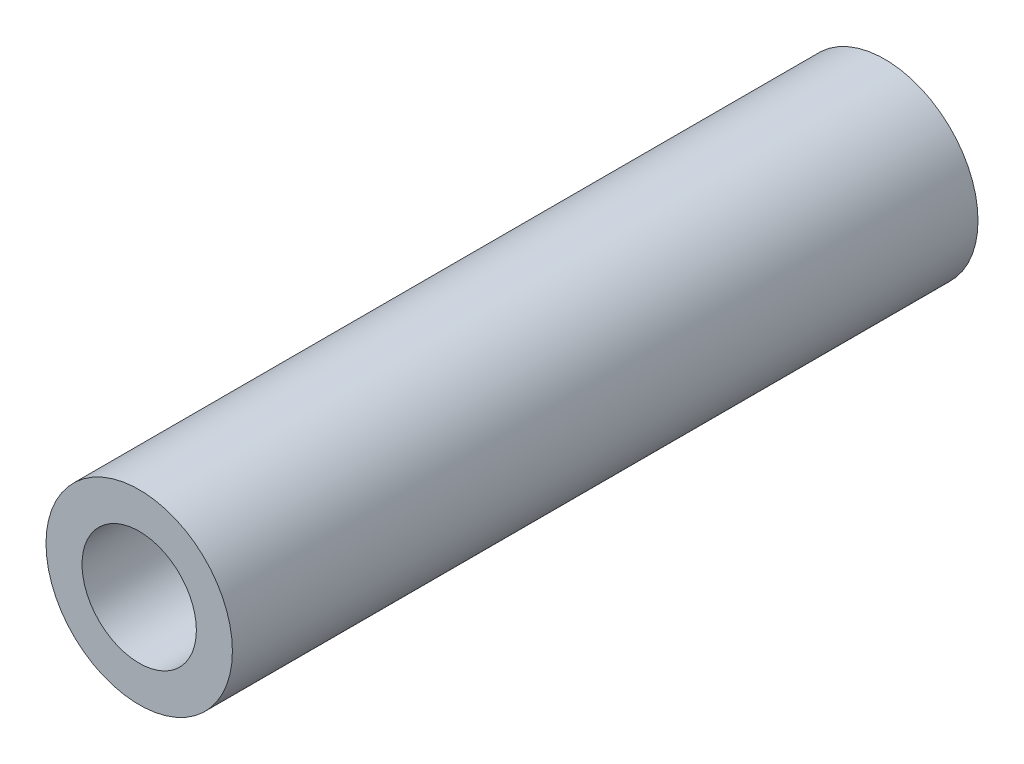
ISO-10303-21;
HEADER;
FILE_DESCRIPTION(('STEP AP214'),'2;1');
FILE_NAME('part.step','',(''),(''),'','','');
FILE_SCHEMA(('AUTOMOTIVE_DESIGN { 1 0 10303 214 1 1 1 1 }'));
ENDSEC;
DATA;
#1=APPLICATION_CONTEXT('core data for automotive mechanical design processes');
#2=APPLICATION_PROTOCOL_DEFINITION('international standard','automotive_design',2000,#1);
#3=PRODUCT_CONTEXT('',#1,'mechanical');
#4=PRODUCT('Part','Part','',(#3));
#5=PRODUCT_RELATED_PRODUCT_CATEGORY('part','',(#4));
#6=PRODUCT_DEFINITION_FORMATION('','',#4);
#7=PRODUCT_DEFINITION_CONTEXT('part definition',#1,'design');
#8=PRODUCT_DEFINITION('design','',#6,#7);
#9=PRODUCT_DEFINITION_SHAPE('','',#8);
#10=(LENGTH_UNIT() NAMED_UNIT(*) SI_UNIT(.MILLI.,.METRE.));
#11=(NAMED_UNIT(*) PLANE_ANGLE_UNIT() SI_UNIT($,.RADIAN.));
#12=(NAMED_UNIT(*) SI_UNIT($,.STERADIAN.) SOLID_ANGLE_UNIT());
#13=UNCERTAINTY_MEASURE_WITH_UNIT(LENGTH_MEASURE(1.E-05),#10,'distance_accuracy_value','');
#14=(GEOMETRIC_REPRESENTATION_CONTEXT(3) GLOBAL_UNCERTAINTY_ASSIGNED_CONTEXT((#13)) GLOBAL_UNIT_ASSIGNED_CONTEXT((#10,
#11,#12)) REPRESENTATION_CONTEXT('',''));
#15=CARTESIAN_POINT('',(0.,0.,0.));
#16=DIRECTION('',(0.,0.,1.));
#17=DIRECTION('',(1.,0.,0.));
#18=AXIS2_PLACEMENT_3D('',#15,#16,#17);
#19=CARTESIAN_POINT('',(0.,0.,9.525));
#20=DIRECTION('',(0.,0.,1.));
#21=DIRECTION('',(1.,0.,0.));
#22=AXIS2_PLACEMENT_3D('',#19,#20,#21);
#23=PLANE('',#22);
#24=CARTESIAN_POINT('',(0.,0.,9.525));
#25=DIRECTION('',(0.,0.,1.));
#26=DIRECTION('',(1.,0.,0.));
#27=AXIS2_PLACEMENT_3D('',#24,#25,#26);
#28=CIRCLE('',#27,2.38125);
#29=CARTESIAN_POINT('',(2.38125,0.,9.525));
#30=VERTEX_POINT('',#29);
#31=EDGE_CURVE('E10',#30,#30,#28,.T.);
#32=ORIENTED_EDGE('',*,*,#31,.T.);
#33=EDGE_LOOP('',(#32));
#34=FACE_BOUND('',#33,.T.);
#35=CARTESIAN_POINT('',(0.,0.,9.525));
#36=DIRECTION('',(0.,0.,1.));
#37=DIRECTION('',(1.,0.,0.));
#38=AXIS2_PLACEMENT_3D('',#35,#36,#37);
#39=CIRCLE('',#38,1.4605);
#40=CARTESIAN_POINT('',(1.4605,0.,9.525));
#41=VERTEX_POINT('',#40);
#42=EDGE_CURVE('E41',#41,#41,#39,.T.);
#43=ORIENTED_EDGE('',*,*,#42,.F.);
#44=EDGE_LOOP('',(#43));
#45=FACE_BOUND('',#44,.T.);
#46=ADVANCED_FACE('F30',(#34,#45),#23,.T.);
#47=CARTESIAN_POINT('',(0.,0.,-9.525));
#48=DIRECTION('',(0.,0.,1.));
#49=DIRECTION('',(1.,0.,0.));
#50=AXIS2_PLACEMENT_3D('',#47,#48,#49);
#51=PLANE('',#50);
#52=CARTESIAN_POINT('',(0.,0.,-9.525));
#53=DIRECTION('',(0.,0.,1.));
#54=DIRECTION('',(1.,0.,0.));
#55=AXIS2_PLACEMENT_3D('',#52,#53,#54);
#56=CIRCLE('',#55,2.38125);
#57=CARTESIAN_POINT('',(2.38125,0.,-9.525));
#58=VERTEX_POINT('',#57);
#59=EDGE_CURVE('E34',#58,#58,#56,.T.);
#60=ORIENTED_EDGE('',*,*,#59,.F.);
#61=EDGE_LOOP('',(#60));
#62=FACE_BOUND('',#61,.T.);
#63=CARTESIAN_POINT('',(0.,0.,-9.525));
#64=DIRECTION('',(0.,0.,1.));
#65=DIRECTION('',(1.,0.,0.));
#66=AXIS2_PLACEMENT_3D('',#63,#64,#65);
#67=CIRCLE('',#66,1.4605);
#68=CARTESIAN_POINT('',(1.4605,0.,-9.525));
#69=VERTEX_POINT('',#68);
#70=EDGE_CURVE('E43',#69,#69,#67,.T.);
#71=ORIENTED_EDGE('',*,*,#70,.T.);
#72=EDGE_LOOP('',(#71));
#73=FACE_BOUND('',#72,.T.);
#74=ADVANCED_FACE('F53',(#62,#73),#51,.F.);
#75=CARTESIAN_POINT('',(0.,0.,9.525));
#76=DIRECTION('',(0.,0.,-1.));
#77=DIRECTION('',(-1.,0.,0.));
#78=AXIS2_PLACEMENT_3D('',#75,#76,#77);
#79=CYLINDRICAL_SURFACE('',#78,2.38125);
#80=ORIENTED_EDGE('',*,*,#31,.F.);
#81=EDGE_LOOP('',(#80));
#82=FACE_BOUND('',#81,.T.);
#83=ORIENTED_EDGE('',*,*,#59,.T.);
#84=EDGE_LOOP('',(#83));
#85=FACE_BOUND('',#84,.T.);
#86=ADVANCED_FACE('F32',(#82,#85),#79,.T.);
#87=CARTESIAN_POINT('',(0.,0.,9.525));
#88=DIRECTION('',(0.,0.,-1.));
#89=DIRECTION('',(-1.,0.,0.));
#90=AXIS2_PLACEMENT_3D('',#87,#88,#89);
#91=CYLINDRICAL_SURFACE('',#90,1.4605);
#92=ORIENTED_EDGE('',*,*,#42,.T.);
#93=EDGE_LOOP('',(#92));
#94=FACE_BOUND('',#93,.T.);
#95=ORIENTED_EDGE('',*,*,#70,.F.);
#96=EDGE_LOOP('',(#95));
#97=FACE_BOUND('',#96,.T.);
#98=ADVANCED_FACE('F49',(#94,#97),#91,.F.);
#99=CLOSED_SHELL('',(#46,#74,#86,#98));
#100=MANIFOLD_SOLID_BREP('B2',#99);
#101=ADVANCED_BREP_SHAPE_REPRESENTATION('',(#18,#100),#14);
#102=SHAPE_DEFINITION_REPRESENTATION(#9,#101);
ENDSEC;
END-ISO-10303-21;
